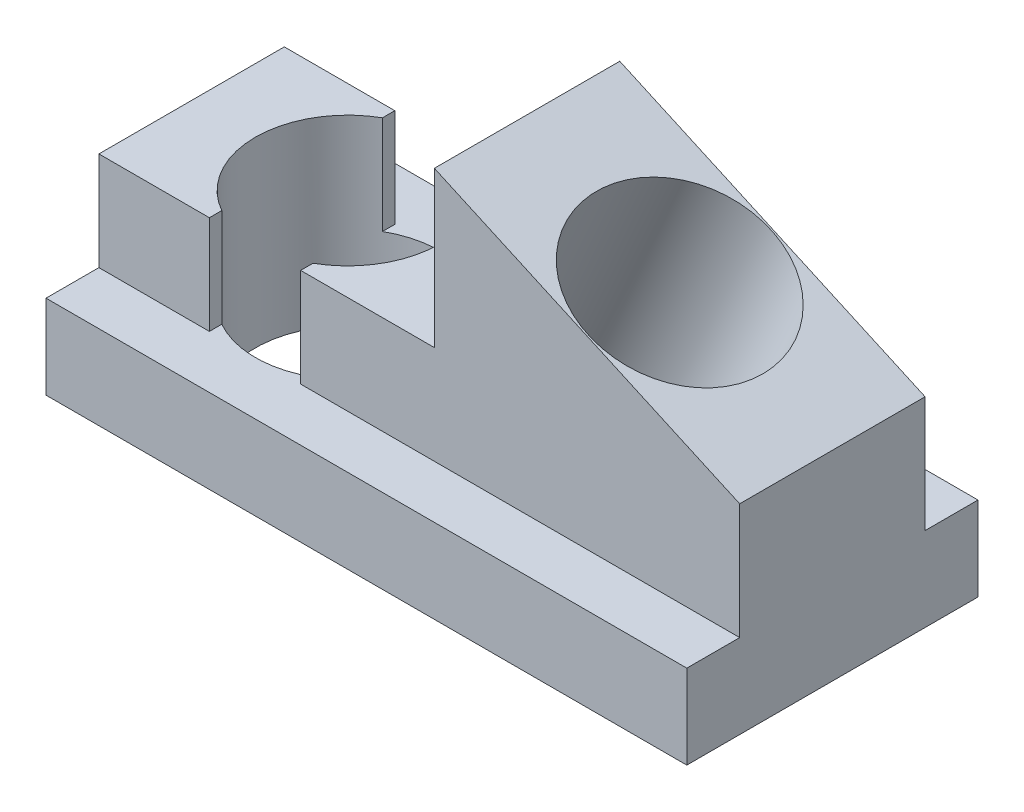
ISO-10303-21;
HEADER;
FILE_DESCRIPTION(('STEP AP214'),'2;1');
FILE_NAME('part.step','',(''),(''),'','','');
FILE_SCHEMA(('AUTOMOTIVE_DESIGN { 1 0 10303 214 1 1 1 1 }'));
ENDSEC;
DATA;
#1=APPLICATION_CONTEXT('core data for automotive mechanical design processes');
#2=APPLICATION_PROTOCOL_DEFINITION('international standard','automotive_design',2000,#1);
#3=PRODUCT_CONTEXT('',#1,'mechanical');
#4=PRODUCT('Part','Part','',(#3));
#5=PRODUCT_RELATED_PRODUCT_CATEGORY('part','',(#4));
#6=PRODUCT_DEFINITION_FORMATION('','',#4);
#7=PRODUCT_DEFINITION_CONTEXT('part definition',#1,'design');
#8=PRODUCT_DEFINITION('design','',#6,#7);
#9=PRODUCT_DEFINITION_SHAPE('','',#8);
#10=(LENGTH_UNIT() NAMED_UNIT(*) SI_UNIT(.MILLI.,.METRE.));
#11=(NAMED_UNIT(*) PLANE_ANGLE_UNIT() SI_UNIT($,.RADIAN.));
#12=(NAMED_UNIT(*) SI_UNIT($,.STERADIAN.) SOLID_ANGLE_UNIT());
#13=UNCERTAINTY_MEASURE_WITH_UNIT(LENGTH_MEASURE(1.E-05),#10,'distance_accuracy_value','');
#14=(GEOMETRIC_REPRESENTATION_CONTEXT(3) GLOBAL_UNCERTAINTY_ASSIGNED_CONTEXT((#13)) GLOBAL_UNIT_ASSIGNED_CONTEXT((#10,
#11,#12)) REPRESENTATION_CONTEXT('',''));
#15=CARTESIAN_POINT('',(0.,0.,0.));
#16=DIRECTION('',(0.,0.,1.));
#17=DIRECTION('',(1.,0.,0.));
#18=AXIS2_PLACEMENT_3D('',#15,#16,#17);
#19=CARTESIAN_POINT('',(0.336340696522832,7.1743537271167,4.064));
#20=DIRECTION('',(0.,0.,1.));
#21=DIRECTION('',(1.,0.,0.));
#22=AXIS2_PLACEMENT_3D('',#19,#20,#21);
#23=PLANE('',#22);
#24=DIRECTION('',(0.,1.,0.));
#25=VECTOR('',#24,1.);
#26=CARTESIAN_POINT('',(-14.0462,8.,4.064));
#27=LINE('',#26,#25);
#28=CARTESIAN_POINT('',(-14.0462,3.683,4.064));
#29=VERTEX_POINT('',#28);
#30=CARTESIAN_POINT('',(-14.0462,8.,4.064));
#31=VERTEX_POINT('',#30);
#32=EDGE_CURVE('E174',#29,#31,#27,.T.);
#33=ORIENTED_EDGE('',*,*,#32,.F.);
#34=DIRECTION('',(1.,0.,0.));
#35=VECTOR('',#34,1.);
#36=CARTESIAN_POINT('',(-14.0462,3.683,4.064));
#37=LINE('',#36,#35);
#38=CARTESIAN_POINT('',(-9.20220000000001,3.683,4.064));
#39=VERTEX_POINT('',#38);
#40=EDGE_CURVE('E225',#29,#39,#37,.T.);
#41=ORIENTED_EDGE('',*,*,#40,.T.);
#42=DIRECTION('',(0.,1.,0.));
#43=VECTOR('',#42,1.);
#44=CARTESIAN_POINT('',(-9.20220000000001,8.,4.064));
#45=LINE('',#44,#43);
#46=CARTESIAN_POINT('',(-9.20220000000001,8.,4.064));
#47=VERTEX_POINT('',#46);
#48=EDGE_CURVE('E204',#39,#47,#45,.T.);
#49=ORIENTED_EDGE('',*,*,#48,.T.);
#50=DIRECTION('',(1.,0.,0.));
#51=VECTOR('',#50,1.);
#52=CARTESIAN_POINT('',(0.660400000000001,8.,4.064));
#53=LINE('',#52,#51);
#54=EDGE_CURVE('E152',#31,#47,#53,.T.);
#55=ORIENTED_EDGE('',*,*,#54,.F.);
#56=EDGE_LOOP('',(#33,#41,#49,#55));
#57=FACE_BOUND('',#56,.T.);
#58=ADVANCED_FACE('F16',(#57),#23,.T.);
#59=CARTESIAN_POINT('',(-14.0462,8.,-4.064));
#60=DIRECTION('',(0.,0.,-1.));
#61=DIRECTION('',(1.,0.,0.));
#62=AXIS2_PLACEMENT_3D('',#59,#60,#61);
#63=PLANE('',#62);
#64=DIRECTION('',(0.,1.,0.));
#65=VECTOR('',#64,1.);
#66=CARTESIAN_POINT('',(-14.0462,8.,-4.064));
#67=LINE('',#66,#65);
#68=CARTESIAN_POINT('',(-14.0462,8.,-4.064));
#69=VERTEX_POINT('',#68);
#70=CARTESIAN_POINT('',(-14.0462,3.683,-4.064));
#71=VERTEX_POINT('',#70);
#72=EDGE_CURVE('E166',#69,#71,#67,.F.);
#73=ORIENTED_EDGE('',*,*,#72,.F.);
#74=DIRECTION('',(1.,0.,0.));
#75=VECTOR('',#74,1.);
#76=CARTESIAN_POINT('',(0.660400000000001,8.,-4.064));
#77=LINE('',#76,#75);
#78=CARTESIAN_POINT('',(-9.20220000000001,8.,-4.064));
#79=VERTEX_POINT('',#78);
#80=EDGE_CURVE('E236',#79,#69,#77,.F.);
#81=ORIENTED_EDGE('',*,*,#80,.F.);
#82=DIRECTION('',(0.,1.,0.));
#83=VECTOR('',#82,1.);
#84=CARTESIAN_POINT('',(-9.20220000000001,8.,-4.064));
#85=LINE('',#84,#83);
#86=CARTESIAN_POINT('',(-9.20220000000001,3.683,-4.064));
#87=VERTEX_POINT('',#86);
#88=EDGE_CURVE('E150',#79,#87,#85,.F.);
#89=ORIENTED_EDGE('',*,*,#88,.T.);
#90=DIRECTION('',(-1.,0.,0.));
#91=VECTOR('',#90,1.);
#92=CARTESIAN_POINT('',(0.,3.683,-4.064));
#93=LINE('',#92,#91);
#94=EDGE_CURVE('E206',#87,#71,#93,.T.);
#95=ORIENTED_EDGE('',*,*,#94,.T.);
#96=EDGE_LOOP('',(#73,#81,#89,#95));
#97=FACE_BOUND('',#96,.T.);
#98=ADVANCED_FACE('F343',(#97),#63,.T.);
#99=CARTESIAN_POINT('',(0.660400000000001,8.,0.));
#100=DIRECTION('',(0.,1.,0.));
#101=DIRECTION('',(0.,0.,1.));
#102=AXIS2_PLACEMENT_3D('',#99,#100,#101);
#103=PLANE('',#102);
#104=DIRECTION('',(0.,0.,1.));
#105=VECTOR('',#104,1.);
#106=CARTESIAN_POINT('',(-14.0462,8.,0.));
#107=LINE('',#106,#105);
#108=EDGE_CURVE('E168',#31,#69,#107,.F.);
#109=ORIENTED_EDGE('',*,*,#108,.F.);
#110=ORIENTED_EDGE('',*,*,#54,.T.);
#111=DIRECTION('',(0.,0.,1.));
#112=VECTOR('',#111,1.);
#113=CARTESIAN_POINT('',(-9.20220000000001,8.,4.064));
#114=LINE('',#113,#112);
#115=CARTESIAN_POINT('',(-9.20220000000001,8.,3.52171833058807));
#116=VERTEX_POINT('',#115);
#117=EDGE_CURVE('E164',#47,#116,#114,.F.);
#118=ORIENTED_EDGE('',*,*,#117,.T.);
#119=CARTESIAN_POINT('',(-7.20220000000001,8.,0.));
#120=DIRECTION('',(0.,-1.,0.));
#121=DIRECTION('',(1.,0.,0.));
#122=AXIS2_PLACEMENT_3D('',#119,#120,#121);
#123=CIRCLE('',#122,4.05);
#124=CARTESIAN_POINT('',(-9.20220000000001,8.,-3.52171833058806));
#125=VERTEX_POINT('',#124);
#126=EDGE_CURVE('E20',#116,#125,#123,.T.);
#127=ORIENTED_EDGE('',*,*,#126,.T.);
#128=DIRECTION('',(0.,0.,1.));
#129=VECTOR('',#128,1.);
#130=CARTESIAN_POINT('',(-9.20220000000001,8.,4.064));
#131=LINE('',#130,#129);
#132=EDGE_CURVE('E146',#125,#79,#131,.F.);
#133=ORIENTED_EDGE('',*,*,#132,.T.);
#134=ORIENTED_EDGE('',*,*,#80,.T.);
#135=EDGE_LOOP('',(#109,#110,#118,#127,#133,#134));
#136=FACE_BOUND('',#135,.T.);
#137=ADVANCED_FACE('F162',(#136),#103,.T.);
#138=CARTESIAN_POINT('',(-9.20220000000001,8.,4.064));
#139=DIRECTION('',(-1.,0.,0.));
#140=DIRECTION('',(0.,0.,1.));
#141=AXIS2_PLACEMENT_3D('',#138,#139,#140);
#142=PLANE('',#141);
#143=DIRECTION('',(0.,0.,-1.));
#144=VECTOR('',#143,1.);
#145=CARTESIAN_POINT('',(-9.20220000000001,3.683,-4.95236916529403));
#146=LINE('',#145,#144);
#147=CARTESIAN_POINT('',(-9.20220000000001,3.683,-3.52171833058807));
#148=VERTEX_POINT('',#147);
#149=EDGE_CURVE('E209',#148,#87,#146,.T.);
#150=ORIENTED_EDGE('',*,*,#149,.T.);
#151=ORIENTED_EDGE('',*,*,#88,.F.);
#152=ORIENTED_EDGE('',*,*,#132,.F.);
#153=DIRECTION('',(0.,-1.,0.));
#154=VECTOR('',#153,1.);
#155=CARTESIAN_POINT('',(-9.20220000000001,8.,-3.52171833058806));
#156=LINE('',#155,#154);
#157=EDGE_CURVE('E149',#125,#148,#156,.T.);
#158=ORIENTED_EDGE('',*,*,#157,.T.);
#159=EDGE_LOOP('',(#150,#151,#152,#158));
#160=FACE_BOUND('',#159,.T.);
#161=ADVANCED_FACE('F148',(#160),#142,.F.);
#162=CARTESIAN_POINT('',(-9.20220000000001,8.,4.064));
#163=DIRECTION('',(-1.,0.,0.));
#164=DIRECTION('',(0.,0.,1.));
#165=AXIS2_PLACEMENT_3D('',#162,#163,#164);
#166=PLANE('',#165);
#167=ORIENTED_EDGE('',*,*,#117,.F.);
#168=ORIENTED_EDGE('',*,*,#48,.F.);
#169=DIRECTION('',(0.,0.,-1.));
#170=VECTOR('',#169,1.);
#171=CARTESIAN_POINT('',(-9.20220000000001,3.683,6.38302));
#172=LINE('',#171,#170);
#173=CARTESIAN_POINT('',(-9.20220000000001,3.683,3.52171833058807));
#174=VERTEX_POINT('',#173);
#175=EDGE_CURVE('E261',#39,#174,#172,.T.);
#176=ORIENTED_EDGE('',*,*,#175,.T.);
#177=DIRECTION('',(0.,-1.,0.));
#178=VECTOR('',#177,1.);
#179=CARTESIAN_POINT('',(-9.20220000000001,8.,3.52171833058807));
#180=LINE('',#179,#178);
#181=EDGE_CURVE('E189',#174,#116,#180,.F.);
#182=ORIENTED_EDGE('',*,*,#181,.T.);
#183=EDGE_LOOP('',(#167,#168,#176,#182));
#184=FACE_BOUND('',#183,.T.);
#185=ADVANCED_FACE('F346',(#184),#166,.F.);
#186=CARTESIAN_POINT('',(-5.20220000000001,3.683,4.064));
#187=DIRECTION('',(1.,0.,0.));
#188=DIRECTION('',(0.,0.,-1.));
#189=AXIS2_PLACEMENT_3D('',#186,#187,#188);
#190=PLANE('',#189);
#191=DIRECTION('',(0.,0.,1.));
#192=VECTOR('',#191,1.);
#193=CARTESIAN_POINT('',(-5.20220000000001,8.,0.));
#194=LINE('',#193,#192);
#195=CARTESIAN_POINT('',(-5.20220000000001,8.,-4.064));
#196=VERTEX_POINT('',#195);
#197=CARTESIAN_POINT('',(-5.20220000000001,8.,-3.52171833058807));
#198=VERTEX_POINT('',#197);
#199=EDGE_CURVE('E263',#196,#198,#194,.T.);
#200=ORIENTED_EDGE('',*,*,#199,.F.);
#201=DIRECTION('',(0.,1.,0.));
#202=VECTOR('',#201,1.);
#203=CARTESIAN_POINT('',(-5.20220000000001,9.2456,-4.064));
#204=LINE('',#203,#202);
#205=CARTESIAN_POINT('',(-5.20220000000001,3.683,-4.064));
#206=VERTEX_POINT('',#205);
#207=EDGE_CURVE('E215',#206,#196,#204,.T.);
#208=ORIENTED_EDGE('',*,*,#207,.F.);
#209=DIRECTION('',(0.,0.,1.));
#210=VECTOR('',#209,1.);
#211=CARTESIAN_POINT('',(-5.20220000000001,3.683,-4.95236916529403));
#212=LINE('',#211,#210);
#213=CARTESIAN_POINT('',(-5.20220000000001,3.683,-3.52171833058807));
#214=VERTEX_POINT('',#213);
#215=EDGE_CURVE('E228',#206,#214,#212,.T.);
#216=ORIENTED_EDGE('',*,*,#215,.T.);
#217=DIRECTION('',(0.,-1.,0.));
#218=VECTOR('',#217,1.);
#219=CARTESIAN_POINT('',(-5.20220000000001,8.,-3.52171833058807));
#220=LINE('',#219,#218);
#221=EDGE_CURVE('E193',#214,#198,#220,.F.);
#222=ORIENTED_EDGE('',*,*,#221,.T.);
#223=EDGE_LOOP('',(#200,#208,#216,#222));
#224=FACE_BOUND('',#223,.T.);
#225=ADVANCED_FACE('F278',(#224),#190,.F.);
#226=CARTESIAN_POINT('',(-5.20220000000001,3.683,4.064));
#227=DIRECTION('',(1.,0.,0.));
#228=DIRECTION('',(0.,0.,-1.));
#229=AXIS2_PLACEMENT_3D('',#226,#227,#228);
#230=PLANE('',#229);
#231=DIRECTION('',(0.,0.,-1.));
#232=VECTOR('',#231,1.);
#233=CARTESIAN_POINT('',(-5.20220000000001,3.683,6.38302));
#234=LINE('',#233,#232);
#235=CARTESIAN_POINT('',(-5.20220000000001,3.683,3.52171833058807));
#236=VERTEX_POINT('',#235);
#237=CARTESIAN_POINT('',(-5.20220000000001,3.683,4.064));
#238=VERTEX_POINT('',#237);
#239=EDGE_CURVE('E229',#236,#238,#234,.F.);
#240=ORIENTED_EDGE('',*,*,#239,.T.);
#241=DIRECTION('',(0.,1.,0.));
#242=VECTOR('',#241,1.);
#243=CARTESIAN_POINT('',(-5.20220000000001,7.1743537271167,4.064));
#244=LINE('',#243,#242);
#245=CARTESIAN_POINT('',(-5.20220000000001,8.,4.064));
#246=VERTEX_POINT('',#245);
#247=EDGE_CURVE('E217',#246,#238,#244,.F.);
#248=ORIENTED_EDGE('',*,*,#247,.F.);
#249=DIRECTION('',(0.,0.,1.));
#250=VECTOR('',#249,1.);
#251=CARTESIAN_POINT('',(-5.20220000000001,8.,0.));
#252=LINE('',#251,#250);
#253=CARTESIAN_POINT('',(-5.20220000000001,8.,3.52171833058807));
#254=VERTEX_POINT('',#253);
#255=EDGE_CURVE('E203',#254,#246,#252,.T.);
#256=ORIENTED_EDGE('',*,*,#255,.F.);
#257=DIRECTION('',(0.,-1.,0.));
#258=VECTOR('',#257,1.);
#259=CARTESIAN_POINT('',(-5.20220000000001,8.,3.52171833058807));
#260=LINE('',#259,#258);
#261=EDGE_CURVE('E190',#254,#236,#260,.T.);
#262=ORIENTED_EDGE('',*,*,#261,.T.);
#263=EDGE_LOOP('',(#240,#248,#256,#262));
#264=FACE_BOUND('',#263,.T.);
#265=ADVANCED_FACE('F268',(#264),#230,.F.);
#266=CARTESIAN_POINT('',(0.660400000000001,8.,0.));
#267=DIRECTION('',(0.,1.,0.));
#268=DIRECTION('',(0.,0.,1.));
#269=AXIS2_PLACEMENT_3D('',#266,#267,#268);
#270=PLANE('',#269);
#271=ORIENTED_EDGE('',*,*,#199,.T.);
#272=CARTESIAN_POINT('',(-7.20220000000001,8.,0.));
#273=DIRECTION('',(0.,-1.,0.));
#274=DIRECTION('',(1.,0.,0.));
#275=AXIS2_PLACEMENT_3D('',#272,#273,#274);
#276=CIRCLE('',#275,4.05);
#277=EDGE_CURVE('E191',#198,#254,#276,.T.);
#278=ORIENTED_EDGE('',*,*,#277,.T.);
#279=ORIENTED_EDGE('',*,*,#255,.T.);
#280=DIRECTION('',(1.,0.,0.));
#281=VECTOR('',#280,1.);
#282=CARTESIAN_POINT('',(0.336340696522832,8.,4.064));
#283=LINE('',#282,#281);
#284=CARTESIAN_POINT('',(0.660400000000001,8.,4.064));
#285=VERTEX_POINT('',#284);
#286=EDGE_CURVE('E231',#285,#246,#283,.F.);
#287=ORIENTED_EDGE('',*,*,#286,.F.);
#288=DIRECTION('',(0.,0.,1.));
#289=VECTOR('',#288,1.);
#290=CARTESIAN_POINT('',(0.660400000000001,8.,0.));
#291=LINE('',#290,#289);
#292=CARTESIAN_POINT('',(0.660400000000001,8.,-4.064));
#293=VERTEX_POINT('',#292);
#294=EDGE_CURVE('E220',#293,#285,#291,.T.);
#295=ORIENTED_EDGE('',*,*,#294,.F.);
#296=DIRECTION('',(1.,0.,0.));
#297=VECTOR('',#296,1.);
#298=CARTESIAN_POINT('',(4.422,8.,-4.064));
#299=LINE('',#298,#297);
#300=EDGE_CURVE('E214',#196,#293,#299,.T.);
#301=ORIENTED_EDGE('',*,*,#300,.F.);
#302=EDGE_LOOP('',(#271,#278,#279,#287,#295,#301));
#303=FACE_BOUND('',#302,.T.);
#304=ADVANCED_FACE('F273',(#303),#270,.T.);
#305=CARTESIAN_POINT('',(-14.0462,3.683,6.38302));
#306=DIRECTION('',(0.,-1.,0.));
#307=DIRECTION('',(0.,0.,-1.));
#308=AXIS2_PLACEMENT_3D('',#305,#306,#307);
#309=PLANE('',#308);
#310=DIRECTION('',(0.,0.,1.));
#311=VECTOR('',#310,1.);
#312=CARTESIAN_POINT('',(-14.0462,3.683,0.));
#313=LINE('',#312,#311);
#314=CARTESIAN_POINT('',(-14.0462,3.683,6.38302));
#315=VERTEX_POINT('',#314);
#316=EDGE_CURVE('E237',#315,#29,#313,.F.);
#317=ORIENTED_EDGE('',*,*,#316,.F.);
#318=DIRECTION('',(1.,0.,0.));
#319=VECTOR('',#318,1.);
#320=CARTESIAN_POINT('',(0.305776245714091,3.68300000000001,6.38302));
#321=LINE('',#320,#319);
#322=CARTESIAN_POINT('',(14.0462,3.683,6.38302));
#323=VERTEX_POINT('',#322);
#324=EDGE_CURVE('E253',#323,#315,#321,.F.);
#325=ORIENTED_EDGE('',*,*,#324,.F.);
#326=DIRECTION('',(0.,0.,-1.));
#327=VECTOR('',#326,1.);
#328=CARTESIAN_POINT('',(14.0462,3.68300000000001,0.));
#329=LINE('',#328,#327);
#330=CARTESIAN_POINT('',(14.0462,3.683,4.064));
#331=VERTEX_POINT('',#330);
#332=EDGE_CURVE('E304',#331,#323,#329,.F.);
#333=ORIENTED_EDGE('',*,*,#332,.F.);
#334=DIRECTION('',(1.,0.,0.));
#335=VECTOR('',#334,1.);
#336=CARTESIAN_POINT('',(0.336340696522832,3.683,4.064));
#337=LINE('',#336,#335);
#338=EDGE_CURVE('E219',#238,#331,#337,.T.);
#339=ORIENTED_EDGE('',*,*,#338,.F.);
#340=ORIENTED_EDGE('',*,*,#239,.F.);
#341=CARTESIAN_POINT('',(-7.20220000000001,3.683,0.));
#342=DIRECTION('',(0.,-1.,0.));
#343=DIRECTION('',(1.,0.,0.));
#344=AXIS2_PLACEMENT_3D('',#341,#342,#343);
#345=CIRCLE('',#344,4.05);
#346=EDGE_CURVE('E186',#236,#174,#345,.T.);
#347=ORIENTED_EDGE('',*,*,#346,.T.);
#348=ORIENTED_EDGE('',*,*,#175,.F.);
#349=ORIENTED_EDGE('',*,*,#40,.F.);
#350=EDGE_LOOP('',(#317,#325,#333,#339,#340,#347,#348,#349));
#351=FACE_BOUND('',#350,.T.);
#352=ADVANCED_FACE('F349',(#351),#309,.F.);
#353=CARTESIAN_POINT('',(14.0462,3.68300000000001,-6.38302));
#354=DIRECTION('',(0.,-1.,0.));
#355=DIRECTION('',(0.,0.,1.));
#356=AXIS2_PLACEMENT_3D('',#353,#354,#355);
#357=PLANE('',#356);
#358=DIRECTION('',(0.,0.,-1.));
#359=VECTOR('',#358,1.);
#360=CARTESIAN_POINT('',(14.0462,3.68300000000001,0.));
#361=LINE('',#360,#359);
#362=CARTESIAN_POINT('',(14.0462,3.68300000000001,-6.38302));
#363=VERTEX_POINT('',#362);
#364=CARTESIAN_POINT('',(14.0462,3.683,-4.064));
#365=VERTEX_POINT('',#364);
#366=EDGE_CURVE('E287',#363,#365,#361,.F.);
#367=ORIENTED_EDGE('',*,*,#366,.F.);
#368=DIRECTION('',(1.,0.,0.));
#369=VECTOR('',#368,1.);
#370=CARTESIAN_POINT('',(0.305776245714091,3.68300000000001,-6.38302));
#371=LINE('',#370,#369);
#372=CARTESIAN_POINT('',(-14.0462,3.683,-6.38302));
#373=VERTEX_POINT('',#372);
#374=EDGE_CURVE('E208',#363,#373,#371,.F.);
#375=ORIENTED_EDGE('',*,*,#374,.T.);
#376=DIRECTION('',(0.,0.,1.));
#377=VECTOR('',#376,1.);
#378=CARTESIAN_POINT('',(-14.0462,3.683,0.));
#379=LINE('',#378,#377);
#380=EDGE_CURVE('E251',#71,#373,#379,.F.);
#381=ORIENTED_EDGE('',*,*,#380,.F.);
#382=ORIENTED_EDGE('',*,*,#94,.F.);
#383=ORIENTED_EDGE('',*,*,#149,.F.);
#384=CARTESIAN_POINT('',(-7.20220000000001,3.683,0.));
#385=DIRECTION('',(0.,-1.,0.));
#386=DIRECTION('',(1.,0.,0.));
#387=AXIS2_PLACEMENT_3D('',#384,#385,#386);
#388=CIRCLE('',#387,4.05);
#389=EDGE_CURVE('E159',#148,#214,#388,.T.);
#390=ORIENTED_EDGE('',*,*,#389,.T.);
#391=ORIENTED_EDGE('',*,*,#215,.F.);
#392=DIRECTION('',(-1.,0.,0.));
#393=VECTOR('',#392,1.);
#394=CARTESIAN_POINT('',(4.422,3.683,-4.064));
#395=LINE('',#394,#393);
#396=EDGE_CURVE('E210',#365,#206,#395,.T.);
#397=ORIENTED_EDGE('',*,*,#396,.F.);
#398=EDGE_LOOP('',(#367,#375,#381,#382,#383,#390,#391,#397));
#399=FACE_BOUND('',#398,.T.);
#400=ADVANCED_FACE('F286',(#399),#357,.F.);
#401=CARTESIAN_POINT('',(0.305776245714091,5.4133116037999,-6.38302));
#402=DIRECTION('',(0.,0.,1.));
#403=DIRECTION('',(1.,0.,0.));
#404=AXIS2_PLACEMENT_3D('',#401,#402,#403);
#405=PLANE('',#404);
#406=DIRECTION('',(0.,1.,0.));
#407=VECTOR('',#406,1.);
#408=CARTESIAN_POINT('',(14.0462,0.,-6.38302));
#409=LINE('',#408,#407);
#410=CARTESIAN_POINT('',(14.0462,0.,-6.38302));
#411=VERTEX_POINT('',#410);
#412=EDGE_CURVE('E294',#411,#363,#409,.T.);
#413=ORIENTED_EDGE('',*,*,#412,.F.);
#414=DIRECTION('',(1.,0.,0.));
#415=VECTOR('',#414,1.);
#416=CARTESIAN_POINT('',(-14.0462,0.,-6.38302));
#417=LINE('',#416,#415);
#418=CARTESIAN_POINT('',(-14.0462,0.,-6.38302));
#419=VERTEX_POINT('',#418);
#420=EDGE_CURVE('E295',#419,#411,#417,.T.);
#421=ORIENTED_EDGE('',*,*,#420,.F.);
#422=DIRECTION('',(0.,1.,0.));
#423=VECTOR('',#422,1.);
#424=CARTESIAN_POINT('',(-14.0462,8.,-6.38302));
#425=LINE('',#424,#423);
#426=EDGE_CURVE('E245',#373,#419,#425,.F.);
#427=ORIENTED_EDGE('',*,*,#426,.F.);
#428=ORIENTED_EDGE('',*,*,#374,.F.);
#429=EDGE_LOOP('',(#413,#421,#427,#428));
#430=FACE_BOUND('',#429,.T.);
#431=ADVANCED_FACE('F340',(#430),#405,.F.);
#432=CARTESIAN_POINT('',(0.305776245714091,5.4133116037999,6.38302));
#433=DIRECTION('',(0.,0.,1.));
#434=DIRECTION('',(1.,0.,0.));
#435=AXIS2_PLACEMENT_3D('',#432,#433,#434);
#436=PLANE('',#435);
#437=DIRECTION('',(1.,0.,0.));
#438=VECTOR('',#437,1.);
#439=CARTESIAN_POINT('',(-14.0462,0.,6.38302));
#440=LINE('',#439,#438);
#441=CARTESIAN_POINT('',(14.0462,0.,6.38302));
#442=VERTEX_POINT('',#441);
#443=CARTESIAN_POINT('',(-14.0462,0.,6.38302));
#444=VERTEX_POINT('',#443);
#445=EDGE_CURVE('E325',#442,#444,#440,.F.);
#446=ORIENTED_EDGE('',*,*,#445,.F.);
#447=DIRECTION('',(0.,1.,0.));
#448=VECTOR('',#447,1.);
#449=CARTESIAN_POINT('',(14.0462,0.,6.38302));
#450=LINE('',#449,#448);
#451=EDGE_CURVE('E299',#323,#442,#450,.F.);
#452=ORIENTED_EDGE('',*,*,#451,.F.);
#453=ORIENTED_EDGE('',*,*,#324,.T.);
#454=DIRECTION('',(0.,1.,0.));
#455=VECTOR('',#454,1.);
#456=CARTESIAN_POINT('',(-14.0462,8.,6.38302));
#457=LINE('',#456,#455);
#458=EDGE_CURVE('E241',#444,#315,#457,.T.);
#459=ORIENTED_EDGE('',*,*,#458,.F.);
#460=EDGE_LOOP('',(#446,#452,#453,#459));
#461=FACE_BOUND('',#460,.T.);
#462=ADVANCED_FACE('F334',(#461),#436,.T.);
#463=CARTESIAN_POINT('',(-14.0462,8.,0.));
#464=DIRECTION('',(-1.,0.,0.));
#465=DIRECTION('',(0.,0.,1.));
#466=AXIS2_PLACEMENT_3D('',#463,#464,#465);
#467=PLANE('',#466);
#468=ORIENTED_EDGE('',*,*,#108,.T.);
#469=ORIENTED_EDGE('',*,*,#72,.T.);
#470=ORIENTED_EDGE('',*,*,#380,.T.);
#471=ORIENTED_EDGE('',*,*,#426,.T.);
#472=DIRECTION('',(0.,0.,-1.));
#473=VECTOR('',#472,1.);
#474=CARTESIAN_POINT('',(-14.0462,0.,0.));
#475=LINE('',#474,#473);
#476=EDGE_CURVE('E185',#444,#419,#475,.T.);
#477=ORIENTED_EDGE('',*,*,#476,.F.);
#478=ORIENTED_EDGE('',*,*,#458,.T.);
#479=ORIENTED_EDGE('',*,*,#316,.T.);
#480=ORIENTED_EDGE('',*,*,#32,.T.);
#481=EDGE_LOOP('',(#468,#469,#470,#471,#477,#478,#479,#480));
#482=FACE_BOUND('',#481,.T.);
#483=ADVANCED_FACE('F337',(#482),#467,.T.);
#484=CARTESIAN_POINT('',(-7.20220000000001,8.,0.));
#485=DIRECTION('',(0.,-1.,0.));
#486=DIRECTION('',(1.,0.,0.));
#487=AXIS2_PLACEMENT_3D('',#484,#485,#486);
#488=CYLINDRICAL_SURFACE('',#487,4.05);
#489=CARTESIAN_POINT('',(-7.20220000000001,0.,0.));
#490=DIRECTION('',(0.,-1.,0.));
#491=DIRECTION('',(1.,0.,0.));
#492=AXIS2_PLACEMENT_3D('',#489,#490,#491);
#493=CIRCLE('',#492,4.05);
#494=CARTESIAN_POINT('',(-3.15220000000001,0.,0.));
#495=VERTEX_POINT('',#494);
#496=EDGE_CURVE('E181',#495,#495,#493,.F.);
#497=ORIENTED_EDGE('',*,*,#496,.F.);
#498=EDGE_LOOP('',(#497));
#499=FACE_BOUND('',#498,.T.);
#500=ORIENTED_EDGE('',*,*,#346,.F.);
#501=ORIENTED_EDGE('',*,*,#261,.F.);
#502=ORIENTED_EDGE('',*,*,#277,.F.);
#503=ORIENTED_EDGE('',*,*,#221,.F.);
#504=ORIENTED_EDGE('',*,*,#389,.F.);
#505=ORIENTED_EDGE('',*,*,#157,.F.);
#506=ORIENTED_EDGE('',*,*,#126,.F.);
#507=ORIENTED_EDGE('',*,*,#181,.F.);
#508=EDGE_LOOP('',(#500,#501,#502,#503,#504,#505,#506,#507));
#509=FACE_BOUND('',#508,.T.);
#510=ADVANCED_FACE('F156',(#499,#509),#488,.F.);
#511=CARTESIAN_POINT('',(-5.20220000000001,14.8082,-4.064));
#512=DIRECTION('',(0.,0.,-1.));
#513=DIRECTION('',(1.,0.,0.));
#514=AXIS2_PLACEMENT_3D('',#511,#512,#513);
#515=PLANE('',#514);
#516=DIRECTION('',(0.,1.,0.));
#517=VECTOR('',#516,1.);
#518=CARTESIAN_POINT('',(14.0462,0.,-4.064));
#519=LINE('',#518,#517);
#520=CARTESIAN_POINT('',(14.0462,8.76300000000001,-4.064));
#521=VERTEX_POINT('',#520);
#522=EDGE_CURVE('E234',#365,#521,#519,.T.);
#523=ORIENTED_EDGE('',*,*,#522,.F.);
#524=ORIENTED_EDGE('',*,*,#396,.T.);
#525=ORIENTED_EDGE('',*,*,#207,.T.);
#526=ORIENTED_EDGE('',*,*,#300,.T.);
#527=DIRECTION('',(0.,1.,0.));
#528=VECTOR('',#527,1.);
#529=CARTESIAN_POINT('',(0.660400000000001,14.8082,-4.064));
#530=LINE('',#529,#528);
#531=CARTESIAN_POINT('',(0.660400000000002,14.8082,-4.064));
#532=VERTEX_POINT('',#531);
#533=EDGE_CURVE('E213',#532,#293,#530,.F.);
#534=ORIENTED_EDGE('',*,*,#533,.F.);
#535=DIRECTION('',(-0.911370599658675,0.411586722426498,0.));
#536=VECTOR('',#535,1.);
#537=CARTESIAN_POINT('',(14.0462,8.76300000000001,-4.064));
#538=LINE('',#537,#536);
#539=EDGE_CURVE('E184',#521,#532,#538,.T.);
#540=ORIENTED_EDGE('',*,*,#539,.F.);
#541=EDGE_LOOP('',(#523,#524,#525,#526,#534,#540));
#542=FACE_BOUND('',#541,.T.);
#543=ADVANCED_FACE('F18',(#542),#515,.T.);
#544=CARTESIAN_POINT('',(0.660400000000001,14.8082,0.));
#545=DIRECTION('',(-1.,0.,0.));
#546=DIRECTION('',(0.,0.,1.));
#547=AXIS2_PLACEMENT_3D('',#544,#545,#546);
#548=PLANE('',#547);
#549=DIRECTION('',(0.,1.,0.));
#550=VECTOR('',#549,1.);
#551=CARTESIAN_POINT('',(0.660400000000001,7.1743537271167,4.064));
#552=LINE('',#551,#550);
#553=CARTESIAN_POINT('',(0.6604,14.8082,4.064));
#554=VERTEX_POINT('',#553);
#555=EDGE_CURVE('E222',#554,#285,#552,.F.);
#556=ORIENTED_EDGE('',*,*,#555,.F.);
#557=DIRECTION('',(0.,0.,1.));
#558=VECTOR('',#557,1.);
#559=CARTESIAN_POINT('',(0.660399999999999,14.8082,0.));
#560=LINE('',#559,#558);
#561=EDGE_CURVE('E315',#532,#554,#560,.T.);
#562=ORIENTED_EDGE('',*,*,#561,.F.);
#563=ORIENTED_EDGE('',*,*,#533,.T.);
#564=ORIENTED_EDGE('',*,*,#294,.T.);
#565=EDGE_LOOP('',(#556,#562,#563,#564));
#566=FACE_BOUND('',#565,.T.);
#567=ADVANCED_FACE('F314',(#566),#548,.T.);
#568=CARTESIAN_POINT('',(0.336340696522832,7.1743537271167,4.064));
#569=DIRECTION('',(0.,0.,1.));
#570=DIRECTION('',(1.,0.,0.));
#571=AXIS2_PLACEMENT_3D('',#568,#569,#570);
#572=PLANE('',#571);
#573=ORIENTED_EDGE('',*,*,#555,.T.);
#574=ORIENTED_EDGE('',*,*,#286,.T.);
#575=ORIENTED_EDGE('',*,*,#247,.T.);
#576=ORIENTED_EDGE('',*,*,#338,.T.);
#577=DIRECTION('',(0.,1.,0.));
#578=VECTOR('',#577,1.);
#579=CARTESIAN_POINT('',(14.0462,0.,4.064));
#580=LINE('',#579,#578);
#581=CARTESIAN_POINT('',(14.0462,8.763,4.064));
#582=VERTEX_POINT('',#581);
#583=EDGE_CURVE('E306',#582,#331,#580,.F.);
#584=ORIENTED_EDGE('',*,*,#583,.F.);
#585=DIRECTION('',(-0.911370599658675,0.411586722426498,0.));
#586=VECTOR('',#585,1.);
#587=CARTESIAN_POINT('',(14.0462,8.76300000000001,4.064));
#588=LINE('',#587,#586);
#589=EDGE_CURVE('E35',#554,#582,#588,.F.);
#590=ORIENTED_EDGE('',*,*,#589,.F.);
#591=EDGE_LOOP('',(#573,#574,#575,#576,#584,#590));
#592=FACE_BOUND('',#591,.T.);
#593=ADVANCED_FACE('F317',(#592),#572,.T.);
#594=CARTESIAN_POINT('',(14.0462,0.,0.));
#595=DIRECTION('',(1.,0.,0.));
#596=DIRECTION('',(0.,0.,-1.));
#597=AXIS2_PLACEMENT_3D('',#594,#595,#596);
#598=PLANE('',#597);
#599=ORIENTED_EDGE('',*,*,#412,.T.);
#600=ORIENTED_EDGE('',*,*,#366,.T.);
#601=ORIENTED_EDGE('',*,*,#522,.T.);
#602=DIRECTION('',(0.,0.,1.));
#603=VECTOR('',#602,1.);
#604=CARTESIAN_POINT('',(14.0462,8.76300000000001,0.));
#605=LINE('',#604,#603);
#606=EDGE_CURVE('E180',#582,#521,#605,.F.);
#607=ORIENTED_EDGE('',*,*,#606,.F.);
#608=ORIENTED_EDGE('',*,*,#583,.T.);
#609=ORIENTED_EDGE('',*,*,#332,.T.);
#610=ORIENTED_EDGE('',*,*,#451,.T.);
#611=DIRECTION('',(0.,0.,-1.));
#612=VECTOR('',#611,1.);
#613=CARTESIAN_POINT('',(14.0462,0.,0.));
#614=LINE('',#613,#612);
#615=EDGE_CURVE('E297',#411,#442,#614,.F.);
#616=ORIENTED_EDGE('',*,*,#615,.F.);
#617=EDGE_LOOP('',(#599,#600,#601,#607,#608,#609,#610,#616));
#618=FACE_BOUND('',#617,.T.);
#619=ADVANCED_FACE('F290',(#618),#598,.T.);
#620=CARTESIAN_POINT('',(-14.0462,0.,0.));
#621=DIRECTION('',(0.,-1.,0.));
#622=DIRECTION('',(0.,0.,-1.));
#623=AXIS2_PLACEMENT_3D('',#620,#621,#622);
#624=PLANE('',#623);
#625=ORIENTED_EDGE('',*,*,#496,.T.);
#626=EDGE_LOOP('',(#625));
#627=FACE_BOUND('',#626,.T.);
#628=CARTESIAN_POINT('',(2.03077096774194,0.,0.));
#629=DIRECTION('',(0.,-1.,0.));
#630=DIRECTION('',(-1.,0.,0.));
#631=AXIS2_PLACEMENT_3D('',#628,#629,#630);
#632=ELLIPSE('',#631,4.3889938972116,4.);
#633=CARTESIAN_POINT('',(-2.35822292946966,0.,0.));
#634=VERTEX_POINT('',#633);
#635=EDGE_CURVE('E26',#634,#634,#632,.F.);
#636=ORIENTED_EDGE('',*,*,#635,.T.);
#637=EDGE_LOOP('',(#636));
#638=FACE_BOUND('',#637,.T.);
#639=ORIENTED_EDGE('',*,*,#445,.T.);
#640=ORIENTED_EDGE('',*,*,#476,.T.);
#641=ORIENTED_EDGE('',*,*,#420,.T.);
#642=ORIENTED_EDGE('',*,*,#615,.T.);
#643=EDGE_LOOP('',(#639,#640,#641,#642));
#644=FACE_BOUND('',#643,.T.);
#645=ADVANCED_FACE('F329',(#627,#638,#644),#624,.T.);
#646=CARTESIAN_POINT('',(14.0462,8.76300000000001,0.));
#647=DIRECTION('',(0.411586722426498,0.911370599658675,0.));
#648=DIRECTION('',(-0.911370599658675,0.411586722426498,0.));
#649=AXIS2_PLACEMENT_3D('',#646,#647,#648);
#650=PLANE('',#649);
#651=CARTESIAN_POINT('',(7.3533,11.7856,0.));
#652=DIRECTION('',(-0.411586722426498,-0.911370599658675,0.));
#653=DIRECTION('',(0.911370599658675,-0.411586722426498,0.));
#654=AXIS2_PLACEMENT_3D('',#651,#652,#653);
#655=CIRCLE('',#654,4.);
#656=CARTESIAN_POINT('',(10.9987823986347,10.139253110294,0.));
#657=VERTEX_POINT('',#656);
#658=EDGE_CURVE('E11',#657,#657,#655,.T.);
#659=ORIENTED_EDGE('',*,*,#658,.T.);
#660=EDGE_LOOP('',(#659));
#661=FACE_BOUND('',#660,.T.);
#662=ORIENTED_EDGE('',*,*,#589,.T.);
#663=ORIENTED_EDGE('',*,*,#606,.T.);
#664=ORIENTED_EDGE('',*,*,#539,.T.);
#665=ORIENTED_EDGE('',*,*,#561,.T.);
#666=EDGE_LOOP('',(#662,#663,#664,#665));
#667=FACE_BOUND('',#666,.T.);
#668=ADVANCED_FACE('F351',(#661,#667),#650,.T.);
#669=CARTESIAN_POINT('',(7.3533,11.7856,0.));
#670=DIRECTION('',(-0.411586722426498,-0.911370599658675,0.));
#671=DIRECTION('',(0.911370599658675,-0.411586722426498,0.));
#672=AXIS2_PLACEMENT_3D('',#669,#670,#671);
#673=CYLINDRICAL_SURFACE('',#672,4.);
#674=ORIENTED_EDGE('',*,*,#658,.F.);
#675=EDGE_LOOP('',(#674));
#676=FACE_BOUND('',#675,.T.);
#677=ORIENTED_EDGE('',*,*,#635,.F.);
#678=EDGE_LOOP('',(#677));
#679=FACE_BOUND('',#678,.T.);
#680=ADVANCED_FACE('F353',(#676,#679),#673,.F.);
#681=CLOSED_SHELL('',(#58,#98,#137,#161,#185,#225,#265,#304,#352,#400,#431,#462,#483,#510,#543,
#567,#593,#619,#645,#668,#680));
#682=MANIFOLD_SOLID_BREP('B1',#681);
#683=ADVANCED_BREP_SHAPE_REPRESENTATION('',(#18,#682),#14);
#684=SHAPE_DEFINITION_REPRESENTATION(#9,#683);
ENDSEC;
END-ISO-10303-21;
